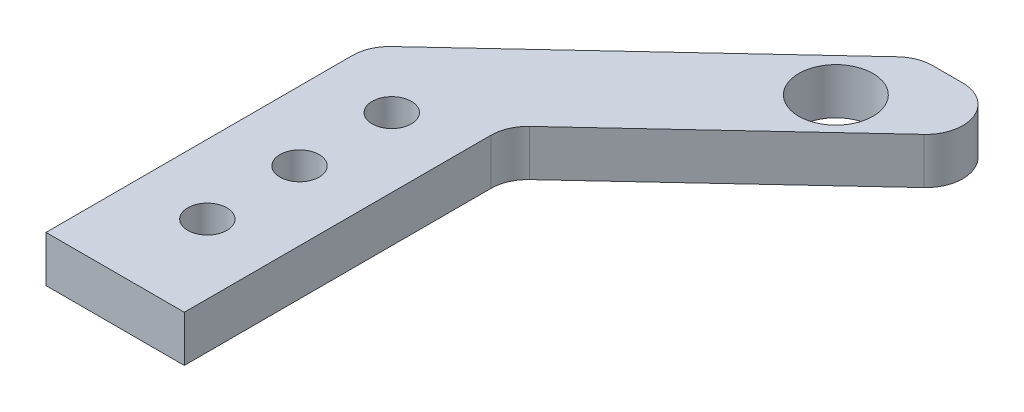
ISO-10303-21;
HEADER;
FILE_DESCRIPTION(('STEP AP214'),'2;1');
FILE_NAME('part.step','',(''),(''),'','','');
FILE_SCHEMA(('AUTOMOTIVE_DESIGN { 1 0 10303 214 1 1 1 1 }'));
ENDSEC;
DATA;
#1=APPLICATION_CONTEXT('core data for automotive mechanical design processes');
#2=APPLICATION_PROTOCOL_DEFINITION('international standard','automotive_design',2000,#1);
#3=PRODUCT_CONTEXT('',#1,'mechanical');
#4=PRODUCT('Part','Part','',(#3));
#5=PRODUCT_RELATED_PRODUCT_CATEGORY('part','',(#4));
#6=PRODUCT_DEFINITION_FORMATION('','',#4);
#7=PRODUCT_DEFINITION_CONTEXT('part definition',#1,'design');
#8=PRODUCT_DEFINITION('design','',#6,#7);
#9=PRODUCT_DEFINITION_SHAPE('','',#8);
#10=(LENGTH_UNIT() NAMED_UNIT(*) SI_UNIT(.MILLI.,.METRE.));
#11=(NAMED_UNIT(*) PLANE_ANGLE_UNIT() SI_UNIT($,.RADIAN.));
#12=(NAMED_UNIT(*) SI_UNIT($,.STERADIAN.) SOLID_ANGLE_UNIT());
#13=UNCERTAINTY_MEASURE_WITH_UNIT(LENGTH_MEASURE(1.E-05),#10,'distance_accuracy_value','');
#14=(GEOMETRIC_REPRESENTATION_CONTEXT(3) GLOBAL_UNCERTAINTY_ASSIGNED_CONTEXT((#13)) GLOBAL_UNIT_ASSIGNED_CONTEXT((#10,
#11,#12)) REPRESENTATION_CONTEXT('',''));
#15=CARTESIAN_POINT('',(0.,0.,0.));
#16=DIRECTION('',(0.,0.,1.));
#17=DIRECTION('',(1.,0.,0.));
#18=AXIS2_PLACEMENT_3D('',#15,#16,#17);
#19=CARTESIAN_POINT('',(0.,2.5,0.));
#20=DIRECTION('',(0.,-1.,0.));
#21=DIRECTION('',(0.,0.,-1.));
#22=AXIS2_PLACEMENT_3D('',#19,#20,#21);
#23=PLANE('',#22);
#24=DIRECTION('',(-0.731443856762478,0.,0.68190166769442));
#25=VECTOR('',#24,1.);
#26=CARTESIAN_POINT('',(-72.5,2.5,-30.));
#27=LINE('',#26,#25);
#28=CARTESIAN_POINT('',(-42.8130203396799,2.5,-57.6762197836823));
#29=VERTEX_POINT('',#28);
#30=CARTESIAN_POINT('',(-71.2276066707777,2.5,-31.1862115255166));
#31=VERTEX_POINT('',#30);
#32=EDGE_CURVE('E141',#29,#31,#27,.T.);
#33=ORIENTED_EDGE('',*,*,#32,.T.);
#34=CARTESIAN_POINT('',(-68.5,2.5,-28.2604360984667));
#35=DIRECTION('',(0.,-1.,0.));
#36=DIRECTION('',(0.,0.,-1.));
#37=AXIS2_PLACEMENT_3D('',#34,#35,#36);
#38=CIRCLE('',#37,4.);
#39=CARTESIAN_POINT('',(-72.5,2.5,-28.2604360984667));
#40=VERTEX_POINT('',#39);
#41=EDGE_CURVE('E117',#31,#40,#38,.F.);
#42=ORIENTED_EDGE('',*,*,#41,.T.);
#43=DIRECTION('',(0.,0.,1.));
#44=VECTOR('',#43,1.);
#45=CARTESIAN_POINT('',(-72.5,2.5,-30.));
#46=LINE('',#45,#44);
#47=CARTESIAN_POINT('',(-72.5,2.5,5.00000000000001));
#48=VERTEX_POINT('',#47);
#49=EDGE_CURVE('E109',#40,#48,#46,.T.);
#50=ORIENTED_EDGE('',*,*,#49,.T.);
#51=DIRECTION('',(1.,0.,0.));
#52=VECTOR('',#51,1.);
#53=CARTESIAN_POINT('',(-57.5,2.5,5.00000000000001));
#54=LINE('',#53,#52);
#55=CARTESIAN_POINT('',(-57.5,2.5,5.00000000000001));
#56=VERTEX_POINT('',#55);
#57=EDGE_CURVE('E114',#48,#56,#54,.T.);
#58=ORIENTED_EDGE('',*,*,#57,.T.);
#59=DIRECTION('',(0.,0.,-1.));
#60=VECTOR('',#59,1.);
#61=CARTESIAN_POINT('',(-57.5,2.5,-30.));
#62=LINE('',#61,#60);
#63=CARTESIAN_POINT('',(-57.5,2.5,-28.2604360984667));
#64=VERTEX_POINT('',#63);
#65=EDGE_CURVE('E131',#56,#64,#62,.T.);
#66=ORIENTED_EDGE('',*,*,#65,.T.);
#67=CARTESIAN_POINT('',(-53.5,2.5,-28.2604360984667));
#68=DIRECTION('',(0.,-1.,0.));
#69=DIRECTION('',(0.,0.,-1.));
#70=AXIS2_PLACEMENT_3D('',#67,#68,#69);
#71=CIRCLE('',#70,4.);
#72=CARTESIAN_POINT('',(-56.2276066707777,2.5,-31.1862115255166));
#73=VERTEX_POINT('',#72);
#74=EDGE_CURVE('E11',#64,#73,#71,.T.);
#75=ORIENTED_EDGE('',*,*,#74,.T.);
#76=DIRECTION('',(0.731443856762478,0.,-0.68190166769442));
#77=VECTOR('',#76,1.);
#78=CARTESIAN_POINT('',(-57.5,2.5,-30.));
#79=LINE('',#78,#77);
#80=CARTESIAN_POINT('',(-34.0897038081864,2.5,-51.8246689295825));
#81=VERTEX_POINT('',#80);
#82=EDGE_CURVE('E188',#73,#81,#79,.T.);
#83=ORIENTED_EDGE('',*,*,#82,.T.);
#84=CARTESIAN_POINT('',(-36.8173104789641,2.5,-54.7504443566324));
#85=DIRECTION('',(0.,-1.,0.));
#86=DIRECTION('',(0.,0.,-1.));
#87=AXIS2_PLACEMENT_3D('',#84,#85,#86);
#88=CIRCLE('',#87,4.);
#89=CARTESIAN_POINT('',(-36.8173104789641,2.5,-58.7504443566324));
#90=VERTEX_POINT('',#89);
#91=EDGE_CURVE('E55',#81,#90,#88,.F.);
#92=ORIENTED_EDGE('',*,*,#91,.T.);
#93=DIRECTION('',(-1.,0.,0.));
#94=VECTOR('',#93,1.);
#95=CARTESIAN_POINT('',(-41.6607501489877,2.5,-58.7504443566324));
#96=LINE('',#95,#94);
#97=CARTESIAN_POINT('',(-40.0854136689023,2.5,-58.7504443566324));
#98=VERTEX_POINT('',#97);
#99=EDGE_CURVE('E192',#90,#98,#96,.T.);
#100=ORIENTED_EDGE('',*,*,#99,.T.);
#101=CARTESIAN_POINT('',(-40.0854136689023,2.5,-54.7504443566324));
#102=DIRECTION('',(0.,-1.,0.));
#103=DIRECTION('',(0.,0.,-1.));
#104=AXIS2_PLACEMENT_3D('',#101,#102,#103);
#105=CIRCLE('',#104,4.);
#106=EDGE_CURVE('E156',#98,#29,#105,.F.);
#107=ORIENTED_EDGE('',*,*,#106,.T.);
#108=EDGE_LOOP('',(#33,#42,#50,#58,#66,#75,#83,#92,#100,#107));
#109=FACE_BOUND('',#108,.T.);
#110=CARTESIAN_POINT('',(-65.,2.5,-25.));
#111=DIRECTION('',(0.,1.,0.));
#112=DIRECTION('',(0.,0.,1.));
#113=AXIS2_PLACEMENT_3D('',#110,#111,#112);
#114=CIRCLE('',#113,2.125);
#115=CARTESIAN_POINT('',(-65.,2.5,-22.875));
#116=VERTEX_POINT('',#115);
#117=EDGE_CURVE('E199',#116,#116,#114,.T.);
#118=ORIENTED_EDGE('',*,*,#117,.F.);
#119=EDGE_LOOP('',(#118));
#120=FACE_BOUND('',#119,.T.);
#121=CARTESIAN_POINT('',(-65.,2.5,-15.));
#122=DIRECTION('',(0.,1.,0.));
#123=DIRECTION('',(0.,0.,1.));
#124=AXIS2_PLACEMENT_3D('',#121,#122,#123);
#125=CIRCLE('',#124,2.125);
#126=CARTESIAN_POINT('',(-65.,2.5,-12.875));
#127=VERTEX_POINT('',#126);
#128=EDGE_CURVE('E370',#127,#127,#125,.T.);
#129=ORIENTED_EDGE('',*,*,#128,.F.);
#130=EDGE_LOOP('',(#129));
#131=FACE_BOUND('',#130,.T.);
#132=CARTESIAN_POINT('',(-42.5846791417331,2.5,-50.7504443566324));
#133=DIRECTION('',(0.,1.,0.));
#134=DIRECTION('',(0.,0.,1.));
#135=AXIS2_PLACEMENT_3D('',#132,#133,#134);
#136=CIRCLE('',#135,4.025);
#137=CARTESIAN_POINT('',(-42.5846791417331,2.5,-46.7254443566324));
#138=VERTEX_POINT('',#137);
#139=EDGE_CURVE('E357',#138,#138,#136,.T.);
#140=ORIENTED_EDGE('',*,*,#139,.F.);
#141=EDGE_LOOP('',(#140));
#142=FACE_BOUND('',#141,.T.);
#143=CARTESIAN_POINT('',(-65.,2.5,-4.99999999999999));
#144=DIRECTION('',(0.,1.,0.));
#145=DIRECTION('',(0.,0.,1.));
#146=AXIS2_PLACEMENT_3D('',#143,#144,#145);
#147=CIRCLE('',#146,2.125);
#148=CARTESIAN_POINT('',(-65.,2.5,-2.87499999999999));
#149=VERTEX_POINT('',#148);
#150=EDGE_CURVE('E361',#149,#149,#147,.T.);
#151=ORIENTED_EDGE('',*,*,#150,.F.);
#152=EDGE_LOOP('',(#151));
#153=FACE_BOUND('',#152,.T.);
#154=ADVANCED_FACE('F33',(#109,#120,#131,#142,#153),#23,.F.);
#155=CARTESIAN_POINT('',(0.,-2.5,0.));
#156=DIRECTION('',(0.,-1.,0.));
#157=DIRECTION('',(0.,0.,-1.));
#158=AXIS2_PLACEMENT_3D('',#155,#156,#157);
#159=PLANE('',#158);
#160=CARTESIAN_POINT('',(-42.5846791417331,-2.5,-50.7504443566324));
#161=DIRECTION('',(0.,1.,0.));
#162=DIRECTION('',(0.,0.,1.));
#163=AXIS2_PLACEMENT_3D('',#160,#161,#162);
#164=CIRCLE('',#163,4.025);
#165=CARTESIAN_POINT('',(-42.5846791417331,-2.5,-46.7254443566324));
#166=VERTEX_POINT('',#165);
#167=EDGE_CURVE('E360',#166,#166,#164,.T.);
#168=ORIENTED_EDGE('',*,*,#167,.T.);
#169=EDGE_LOOP('',(#168));
#170=FACE_BOUND('',#169,.T.);
#171=CARTESIAN_POINT('',(-65.,-2.5,-25.));
#172=DIRECTION('',(0.,1.,0.));
#173=DIRECTION('',(0.,0.,1.));
#174=AXIS2_PLACEMENT_3D('',#171,#172,#173);
#175=CIRCLE('',#174,2.125);
#176=CARTESIAN_POINT('',(-65.,-2.5,-22.875));
#177=VERTEX_POINT('',#176);
#178=EDGE_CURVE('E373',#177,#177,#175,.T.);
#179=ORIENTED_EDGE('',*,*,#178,.T.);
#180=EDGE_LOOP('',(#179));
#181=FACE_BOUND('',#180,.T.);
#182=DIRECTION('',(0.,0.,1.));
#183=VECTOR('',#182,1.);
#184=CARTESIAN_POINT('',(-72.5,-2.5,-30.));
#185=LINE('',#184,#183);
#186=CARTESIAN_POINT('',(-72.5,-2.5,-28.2604360984667));
#187=VERTEX_POINT('',#186);
#188=CARTESIAN_POINT('',(-72.5,-2.5,5.00000000000001));
#189=VERTEX_POINT('',#188);
#190=EDGE_CURVE('E135',#187,#189,#185,.T.);
#191=ORIENTED_EDGE('',*,*,#190,.F.);
#192=CARTESIAN_POINT('',(-68.5,-2.5,-28.2604360984667));
#193=DIRECTION('',(0.,-1.,0.));
#194=DIRECTION('',(0.,0.,-1.));
#195=AXIS2_PLACEMENT_3D('',#192,#193,#194);
#196=CIRCLE('',#195,4.);
#197=CARTESIAN_POINT('',(-71.2276066707777,-2.5,-31.1862115255166));
#198=VERTEX_POINT('',#197);
#199=EDGE_CURVE('E148',#187,#198,#196,.T.);
#200=ORIENTED_EDGE('',*,*,#199,.T.);
#201=DIRECTION('',(-0.731443856762478,0.,0.68190166769442));
#202=VECTOR('',#201,1.);
#203=CARTESIAN_POINT('',(-72.5,-2.5,-30.));
#204=LINE('',#203,#202);
#205=CARTESIAN_POINT('',(-42.8130203396799,-2.5,-57.6762197836823));
#206=VERTEX_POINT('',#205);
#207=EDGE_CURVE('E122',#206,#198,#204,.T.);
#208=ORIENTED_EDGE('',*,*,#207,.F.);
#209=CARTESIAN_POINT('',(-40.0854136689023,-2.5,-54.7504443566324));
#210=DIRECTION('',(0.,-1.,0.));
#211=DIRECTION('',(0.,0.,-1.));
#212=AXIS2_PLACEMENT_3D('',#209,#210,#211);
#213=CIRCLE('',#212,4.);
#214=CARTESIAN_POINT('',(-40.0854136689023,-2.5,-58.7504443566324));
#215=VERTEX_POINT('',#214);
#216=EDGE_CURVE('E146',#206,#215,#213,.T.);
#217=ORIENTED_EDGE('',*,*,#216,.T.);
#218=DIRECTION('',(-1.,0.,0.));
#219=VECTOR('',#218,1.);
#220=CARTESIAN_POINT('',(-41.6607501489877,-2.5,-58.7504443566324));
#221=LINE('',#220,#219);
#222=CARTESIAN_POINT('',(-36.8173104789641,-2.5,-58.7504443566324));
#223=VERTEX_POINT('',#222);
#224=EDGE_CURVE('E202',#223,#215,#221,.T.);
#225=ORIENTED_EDGE('',*,*,#224,.F.);
#226=CARTESIAN_POINT('',(-36.8173104789641,-2.5,-54.7504443566324));
#227=DIRECTION('',(0.,-1.,0.));
#228=DIRECTION('',(0.,0.,-1.));
#229=AXIS2_PLACEMENT_3D('',#226,#227,#228);
#230=CIRCLE('',#229,4.);
#231=CARTESIAN_POINT('',(-34.0897038081864,-2.5,-51.8246689295825));
#232=VERTEX_POINT('',#231);
#233=EDGE_CURVE('E139',#223,#232,#230,.T.);
#234=ORIENTED_EDGE('',*,*,#233,.T.);
#235=DIRECTION('',(0.731443856762478,0.,-0.68190166769442));
#236=VECTOR('',#235,1.);
#237=CARTESIAN_POINT('',(-57.5,-2.5,-30.));
#238=LINE('',#237,#236);
#239=CARTESIAN_POINT('',(-56.2276066707777,-2.5,-31.1862115255166));
#240=VERTEX_POINT('',#239);
#241=EDGE_CURVE('E177',#240,#232,#238,.T.);
#242=ORIENTED_EDGE('',*,*,#241,.F.);
#243=CARTESIAN_POINT('',(-53.5,-2.5,-28.2604360984667));
#244=DIRECTION('',(0.,-1.,0.));
#245=DIRECTION('',(0.,0.,-1.));
#246=AXIS2_PLACEMENT_3D('',#243,#244,#245);
#247=CIRCLE('',#246,4.);
#248=CARTESIAN_POINT('',(-57.5,-2.5,-28.2604360984667));
#249=VERTEX_POINT('',#248);
#250=EDGE_CURVE('E41',#240,#249,#247,.F.);
#251=ORIENTED_EDGE('',*,*,#250,.T.);
#252=DIRECTION('',(0.,0.,-1.));
#253=VECTOR('',#252,1.);
#254=CARTESIAN_POINT('',(-57.5,-2.5,-30.));
#255=LINE('',#254,#253);
#256=CARTESIAN_POINT('',(-57.5,-2.5,5.00000000000001));
#257=VERTEX_POINT('',#256);
#258=EDGE_CURVE('E175',#257,#249,#255,.T.);
#259=ORIENTED_EDGE('',*,*,#258,.F.);
#260=DIRECTION('',(1.,0.,0.));
#261=VECTOR('',#260,1.);
#262=CARTESIAN_POINT('',(-57.5,-2.5,5.00000000000001));
#263=LINE('',#262,#261);
#264=EDGE_CURVE('E183',#189,#257,#263,.T.);
#265=ORIENTED_EDGE('',*,*,#264,.F.);
#266=EDGE_LOOP('',(#191,#200,#208,#217,#225,#234,#242,#251,#259,#265));
#267=FACE_BOUND('',#266,.T.);
#268=CARTESIAN_POINT('',(-65.,-2.5,-15.));
#269=DIRECTION('',(0.,1.,0.));
#270=DIRECTION('',(0.,0.,1.));
#271=AXIS2_PLACEMENT_3D('',#268,#269,#270);
#272=CIRCLE('',#271,2.125);
#273=CARTESIAN_POINT('',(-65.,-2.5,-12.875));
#274=VERTEX_POINT('',#273);
#275=EDGE_CURVE('E363',#274,#274,#272,.T.);
#276=ORIENTED_EDGE('',*,*,#275,.T.);
#277=EDGE_LOOP('',(#276));
#278=FACE_BOUND('',#277,.T.);
#279=CARTESIAN_POINT('',(-65.,-2.5,-4.99999999999999));
#280=DIRECTION('',(0.,1.,0.));
#281=DIRECTION('',(0.,0.,1.));
#282=AXIS2_PLACEMENT_3D('',#279,#280,#281);
#283=CIRCLE('',#282,2.125);
#284=CARTESIAN_POINT('',(-65.,-2.5,-2.87499999999999));
#285=VERTEX_POINT('',#284);
#286=EDGE_CURVE('E366',#285,#285,#283,.T.);
#287=ORIENTED_EDGE('',*,*,#286,.T.);
#288=EDGE_LOOP('',(#287));
#289=FACE_BOUND('',#288,.T.);
#290=ADVANCED_FACE('F173',(#170,#181,#267,#278,#289),#159,.T.);
#291=CARTESIAN_POINT('',(-72.5,2.5,-30.));
#292=DIRECTION('',(1.,0.,0.));
#293=DIRECTION('',(0.,0.,-1.));
#294=AXIS2_PLACEMENT_3D('',#291,#292,#293);
#295=PLANE('',#294);
#296=ORIENTED_EDGE('',*,*,#49,.F.);
#297=DIRECTION('',(0.,-1.,0.));
#298=VECTOR('',#297,1.);
#299=CARTESIAN_POINT('',(-72.5,2.5,-28.2604360984667));
#300=LINE('',#299,#298);
#301=EDGE_CURVE('E137',#40,#187,#300,.T.);
#302=ORIENTED_EDGE('',*,*,#301,.T.);
#303=ORIENTED_EDGE('',*,*,#190,.T.);
#304=DIRECTION('',(0.,-1.,0.));
#305=VECTOR('',#304,1.);
#306=CARTESIAN_POINT('',(-72.5,2.5,5.00000000000001));
#307=LINE('',#306,#305);
#308=EDGE_CURVE('E127',#48,#189,#307,.T.);
#309=ORIENTED_EDGE('',*,*,#308,.F.);
#310=EDGE_LOOP('',(#296,#302,#303,#309));
#311=FACE_BOUND('',#310,.T.);
#312=ADVANCED_FACE('F133',(#311),#295,.F.);
#313=CARTESIAN_POINT('',(-57.5,2.5,5.00000000000001));
#314=DIRECTION('',(0.,0.,-1.));
#315=DIRECTION('',(-1.,0.,0.));
#316=AXIS2_PLACEMENT_3D('',#313,#314,#315);
#317=PLANE('',#316);
#318=ORIENTED_EDGE('',*,*,#264,.T.);
#319=DIRECTION('',(0.,-1.,0.));
#320=VECTOR('',#319,1.);
#321=CARTESIAN_POINT('',(-57.5,2.5,5.00000000000001));
#322=LINE('',#321,#320);
#323=EDGE_CURVE('E129',#56,#257,#322,.T.);
#324=ORIENTED_EDGE('',*,*,#323,.F.);
#325=ORIENTED_EDGE('',*,*,#57,.F.);
#326=ORIENTED_EDGE('',*,*,#308,.T.);
#327=EDGE_LOOP('',(#318,#324,#325,#326));
#328=FACE_BOUND('',#327,.T.);
#329=ADVANCED_FACE('F126',(#328),#317,.F.);
#330=CARTESIAN_POINT('',(-57.5,2.5,-30.));
#331=DIRECTION('',(-1.,0.,0.));
#332=DIRECTION('',(0.,0.,1.));
#333=AXIS2_PLACEMENT_3D('',#330,#331,#332);
#334=PLANE('',#333);
#335=ORIENTED_EDGE('',*,*,#258,.T.);
#336=DIRECTION('',(0.,-1.,0.));
#337=VECTOR('',#336,1.);
#338=CARTESIAN_POINT('',(-57.5,2.5,-28.2604360984667));
#339=LINE('',#338,#337);
#340=EDGE_CURVE('E168',#249,#64,#339,.F.);
#341=ORIENTED_EDGE('',*,*,#340,.T.);
#342=ORIENTED_EDGE('',*,*,#65,.F.);
#343=ORIENTED_EDGE('',*,*,#323,.T.);
#344=EDGE_LOOP('',(#335,#341,#342,#343));
#345=FACE_BOUND('',#344,.T.);
#346=ADVANCED_FACE('F182',(#345),#334,.F.);
#347=CARTESIAN_POINT('',(-57.5,2.5,-30.));
#348=DIRECTION('',(-0.68190166769442,0.,-0.731443856762478));
#349=DIRECTION('',(-0.731443856762478,0.,0.68190166769442));
#350=AXIS2_PLACEMENT_3D('',#347,#348,#349);
#351=PLANE('',#350);
#352=ORIENTED_EDGE('',*,*,#82,.F.);
#353=DIRECTION('',(0.,-1.,0.));
#354=VECTOR('',#353,1.);
#355=CARTESIAN_POINT('',(-56.2276066707777,-2.5,-31.1862115255166));
#356=LINE('',#355,#354);
#357=EDGE_CURVE('E165',#73,#240,#356,.T.);
#358=ORIENTED_EDGE('',*,*,#357,.T.);
#359=ORIENTED_EDGE('',*,*,#241,.T.);
#360=DIRECTION('',(0.,-1.,0.));
#361=VECTOR('',#360,1.);
#362=CARTESIAN_POINT('',(-34.0897038081864,2.5,-51.8246689295825));
#363=LINE('',#362,#361);
#364=EDGE_CURVE('E163',#232,#81,#363,.F.);
#365=ORIENTED_EDGE('',*,*,#364,.T.);
#366=EDGE_LOOP('',(#352,#358,#359,#365));
#367=FACE_BOUND('',#366,.T.);
#368=ADVANCED_FACE('F190',(#367),#351,.F.);
#369=CARTESIAN_POINT('',(-41.6607501489877,2.5,-58.7504443566324));
#370=DIRECTION('',(0.,0.,1.));
#371=DIRECTION('',(1.,0.,0.));
#372=AXIS2_PLACEMENT_3D('',#369,#370,#371);
#373=PLANE('',#372);
#374=ORIENTED_EDGE('',*,*,#224,.T.);
#375=DIRECTION('',(0.,-1.,0.));
#376=VECTOR('',#375,1.);
#377=CARTESIAN_POINT('',(-40.0854136689023,2.5,-58.7504443566324));
#378=LINE('',#377,#376);
#379=EDGE_CURVE('E48',#215,#98,#378,.F.);
#380=ORIENTED_EDGE('',*,*,#379,.T.);
#381=ORIENTED_EDGE('',*,*,#99,.F.);
#382=DIRECTION('',(0.,-1.,0.));
#383=VECTOR('',#382,1.);
#384=CARTESIAN_POINT('',(-36.8173104789641,2.5,-58.7504443566324));
#385=LINE('',#384,#383);
#386=EDGE_CURVE('E159',#90,#223,#385,.T.);
#387=ORIENTED_EDGE('',*,*,#386,.T.);
#388=EDGE_LOOP('',(#374,#380,#381,#387));
#389=FACE_BOUND('',#388,.T.);
#390=ADVANCED_FACE('F239',(#389),#373,.F.);
#391=CARTESIAN_POINT('',(-72.5,2.5,-30.));
#392=DIRECTION('',(0.68190166769442,0.,0.731443856762478));
#393=DIRECTION('',(0.731443856762478,0.,-0.68190166769442));
#394=AXIS2_PLACEMENT_3D('',#391,#392,#393);
#395=PLANE('',#394);
#396=ORIENTED_EDGE('',*,*,#207,.T.);
#397=DIRECTION('',(0.,-1.,0.));
#398=VECTOR('',#397,1.);
#399=CARTESIAN_POINT('',(-71.2276066707777,2.5,-31.1862115255166));
#400=LINE('',#399,#398);
#401=EDGE_CURVE('E153',#198,#31,#400,.F.);
#402=ORIENTED_EDGE('',*,*,#401,.T.);
#403=ORIENTED_EDGE('',*,*,#32,.F.);
#404=DIRECTION('',(0.,-1.,0.));
#405=VECTOR('',#404,1.);
#406=CARTESIAN_POINT('',(-42.8130203396799,2.5,-57.6762197836823));
#407=LINE('',#406,#405);
#408=EDGE_CURVE('E150',#29,#206,#407,.T.);
#409=ORIENTED_EDGE('',*,*,#408,.T.);
#410=EDGE_LOOP('',(#396,#402,#403,#409));
#411=FACE_BOUND('',#410,.T.);
#412=ADVANCED_FACE('F207',(#411),#395,.F.);
#413=CARTESIAN_POINT('',(-65.,2.5,-25.));
#414=DIRECTION('',(0.,-1.,0.));
#415=DIRECTION('',(0.,0.,-1.));
#416=AXIS2_PLACEMENT_3D('',#413,#414,#415);
#417=CYLINDRICAL_SURFACE('',#416,2.125);
#418=ORIENTED_EDGE('',*,*,#117,.T.);
#419=EDGE_LOOP('',(#418));
#420=FACE_BOUND('',#419,.T.);
#421=ORIENTED_EDGE('',*,*,#178,.F.);
#422=EDGE_LOOP('',(#421));
#423=FACE_BOUND('',#422,.T.);
#424=ADVANCED_FACE('F234',(#420,#423),#417,.F.);
#425=CARTESIAN_POINT('',(-65.,2.5,-15.));
#426=DIRECTION('',(0.,-1.,0.));
#427=DIRECTION('',(0.,0.,-1.));
#428=AXIS2_PLACEMENT_3D('',#425,#426,#427);
#429=CYLINDRICAL_SURFACE('',#428,2.125);
#430=ORIENTED_EDGE('',*,*,#128,.T.);
#431=EDGE_LOOP('',(#430));
#432=FACE_BOUND('',#431,.T.);
#433=ORIENTED_EDGE('',*,*,#275,.F.);
#434=EDGE_LOOP('',(#433));
#435=FACE_BOUND('',#434,.T.);
#436=ADVANCED_FACE('F278',(#432,#435),#429,.F.);
#437=CARTESIAN_POINT('',(-42.5846791417331,2.5,-50.7504443566324));
#438=DIRECTION('',(0.,-1.,0.));
#439=DIRECTION('',(0.,0.,-1.));
#440=AXIS2_PLACEMENT_3D('',#437,#438,#439);
#441=CYLINDRICAL_SURFACE('',#440,4.025);
#442=ORIENTED_EDGE('',*,*,#139,.T.);
#443=EDGE_LOOP('',(#442));
#444=FACE_BOUND('',#443,.T.);
#445=ORIENTED_EDGE('',*,*,#167,.F.);
#446=EDGE_LOOP('',(#445));
#447=FACE_BOUND('',#446,.T.);
#448=ADVANCED_FACE('F222',(#444,#447),#441,.F.);
#449=CARTESIAN_POINT('',(-65.,2.5,-4.99999999999999));
#450=DIRECTION('',(0.,-1.,0.));
#451=DIRECTION('',(0.,0.,-1.));
#452=AXIS2_PLACEMENT_3D('',#449,#450,#451);
#453=CYLINDRICAL_SURFACE('',#452,2.125);
#454=ORIENTED_EDGE('',*,*,#150,.T.);
#455=EDGE_LOOP('',(#454));
#456=FACE_BOUND('',#455,.T.);
#457=ORIENTED_EDGE('',*,*,#286,.F.);
#458=EDGE_LOOP('',(#457));
#459=FACE_BOUND('',#458,.T.);
#460=ADVANCED_FACE('F214',(#456,#459),#453,.F.);
#461=CARTESIAN_POINT('',(-68.5,2.5,-28.2604360984667));
#462=DIRECTION('',(0.,-1.,0.));
#463=DIRECTION('',(0.,0.,-1.));
#464=AXIS2_PLACEMENT_3D('',#461,#462,#463);
#465=CYLINDRICAL_SURFACE('',#464,4.);
#466=ORIENTED_EDGE('',*,*,#41,.F.);
#467=ORIENTED_EDGE('',*,*,#401,.F.);
#468=ORIENTED_EDGE('',*,*,#199,.F.);
#469=ORIENTED_EDGE('',*,*,#301,.F.);
#470=EDGE_LOOP('',(#466,#467,#468,#469));
#471=FACE_BOUND('',#470,.T.);
#472=ADVANCED_FACE('F211',(#471),#465,.T.);
#473=CARTESIAN_POINT('',(-40.0854136689023,2.5,-54.7504443566324));
#474=DIRECTION('',(0.,-1.,0.));
#475=DIRECTION('',(0.,0.,-1.));
#476=AXIS2_PLACEMENT_3D('',#473,#474,#475);
#477=CYLINDRICAL_SURFACE('',#476,4.);
#478=ORIENTED_EDGE('',*,*,#106,.F.);
#479=ORIENTED_EDGE('',*,*,#379,.F.);
#480=ORIENTED_EDGE('',*,*,#216,.F.);
#481=ORIENTED_EDGE('',*,*,#408,.F.);
#482=EDGE_LOOP('',(#478,#479,#480,#481));
#483=FACE_BOUND('',#482,.T.);
#484=ADVANCED_FACE('F213',(#483),#477,.T.);
#485=CARTESIAN_POINT('',(-53.5,2.5,-28.2604360984667));
#486=DIRECTION('',(0.,1.,0.));
#487=DIRECTION('',(0.,0.,1.));
#488=AXIS2_PLACEMENT_3D('',#485,#486,#487);
#489=CYLINDRICAL_SURFACE('',#488,4.);
#490=ORIENTED_EDGE('',*,*,#74,.F.);
#491=ORIENTED_EDGE('',*,*,#340,.F.);
#492=ORIENTED_EDGE('',*,*,#250,.F.);
#493=ORIENTED_EDGE('',*,*,#357,.F.);
#494=EDGE_LOOP('',(#490,#491,#492,#493));
#495=FACE_BOUND('',#494,.T.);
#496=ADVANCED_FACE('F186',(#495),#489,.F.);
#497=CARTESIAN_POINT('',(-36.8173104789641,2.5,-54.7504443566324));
#498=DIRECTION('',(0.,-1.,0.));
#499=DIRECTION('',(0.,0.,-1.));
#500=AXIS2_PLACEMENT_3D('',#497,#498,#499);
#501=CYLINDRICAL_SURFACE('',#500,4.);
#502=ORIENTED_EDGE('',*,*,#91,.F.);
#503=ORIENTED_EDGE('',*,*,#364,.F.);
#504=ORIENTED_EDGE('',*,*,#233,.F.);
#505=ORIENTED_EDGE('',*,*,#386,.F.);
#506=EDGE_LOOP('',(#502,#503,#504,#505));
#507=FACE_BOUND('',#506,.T.);
#508=ADVANCED_FACE('F35',(#507),#501,.T.);
#509=CLOSED_SHELL('',(#154,#290,#312,#329,#346,#368,#390,#412,#424,#436,#448,#460,#472,#484,
#496,#508));
#510=MANIFOLD_SOLID_BREP('B2',#509);
#511=ADVANCED_BREP_SHAPE_REPRESENTATION('',(#18,#510),#14);
#512=SHAPE_DEFINITION_REPRESENTATION(#9,#511);
ENDSEC;
END-ISO-10303-21;
